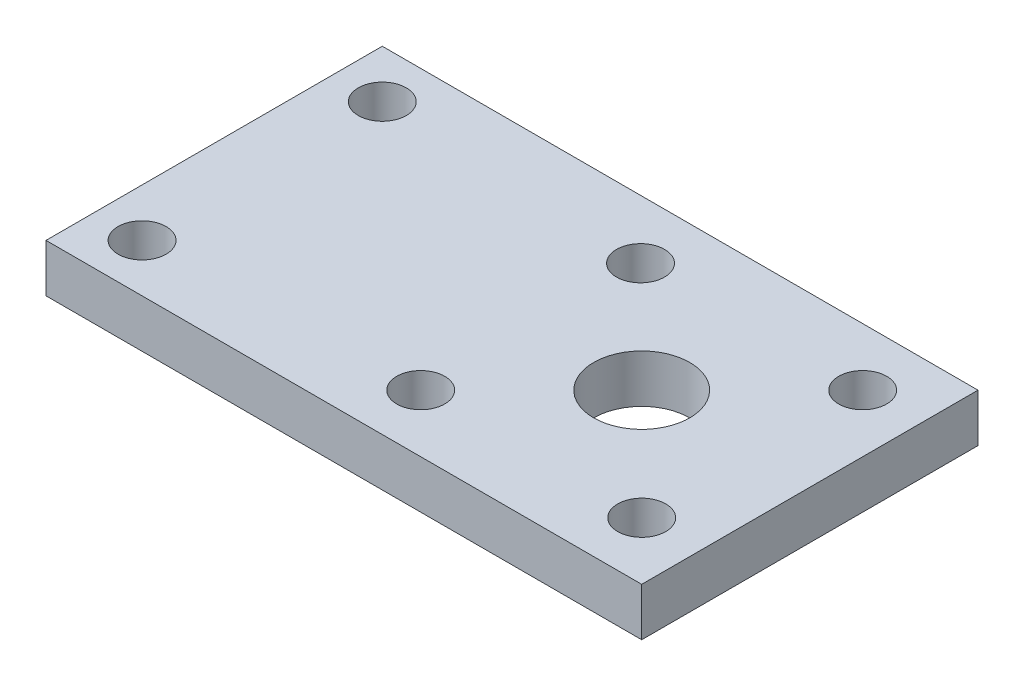
ISO-10303-21;
HEADER;
FILE_DESCRIPTION(('STEP AP214'),'2;1');
FILE_NAME('part.step','',(''),(''),'','','');
FILE_SCHEMA(('AUTOMOTIVE_DESIGN { 1 0 10303 214 1 1 1 1 }'));
ENDSEC;
DATA;
#1=APPLICATION_CONTEXT('core data for automotive mechanical design processes');
#2=APPLICATION_PROTOCOL_DEFINITION('international standard','automotive_design',2000,#1);
#3=PRODUCT_CONTEXT('',#1,'mechanical');
#4=PRODUCT('Part','Part','',(#3));
#5=PRODUCT_RELATED_PRODUCT_CATEGORY('part','',(#4));
#6=PRODUCT_DEFINITION_FORMATION('','',#4);
#7=PRODUCT_DEFINITION_CONTEXT('part definition',#1,'design');
#8=PRODUCT_DEFINITION('design','',#6,#7);
#9=PRODUCT_DEFINITION_SHAPE('','',#8);
#10=(LENGTH_UNIT() NAMED_UNIT(*) SI_UNIT(.MILLI.,.METRE.));
#11=(NAMED_UNIT(*) PLANE_ANGLE_UNIT() SI_UNIT($,.RADIAN.));
#12=(NAMED_UNIT(*) SI_UNIT($,.STERADIAN.) SOLID_ANGLE_UNIT());
#13=UNCERTAINTY_MEASURE_WITH_UNIT(LENGTH_MEASURE(1.E-05),#10,'distance_accuracy_value','');
#14=(GEOMETRIC_REPRESENTATION_CONTEXT(3) GLOBAL_UNCERTAINTY_ASSIGNED_CONTEXT((#13)) GLOBAL_UNIT_ASSIGNED_CONTEXT((#10,
#11,#12)) REPRESENTATION_CONTEXT('',''));
#15=CARTESIAN_POINT('',(0.,0.,0.));
#16=DIRECTION('',(0.,0.,1.));
#17=DIRECTION('',(1.,0.,0.));
#18=AXIS2_PLACEMENT_3D('',#15,#16,#17);
#19=CARTESIAN_POINT('',(0.,5.,0.));
#20=DIRECTION('',(1.,0.,0.));
#21=DIRECTION('',(0.,0.,-1.));
#22=AXIS2_PLACEMENT_3D('',#19,#20,#21);
#23=PLANE('',#22);
#24=DIRECTION('',(0.,0.,1.));
#25=VECTOR('',#24,1.);
#26=CARTESIAN_POINT('',(0.,0.,0.));
#27=LINE('',#26,#25);
#28=CARTESIAN_POINT('',(0.,0.,-35.));
#29=VERTEX_POINT('',#28);
#30=CARTESIAN_POINT('',(0.,0.,0.));
#31=VERTEX_POINT('',#30);
#32=EDGE_CURVE('E100',#29,#31,#27,.T.);
#33=ORIENTED_EDGE('',*,*,#32,.T.);
#34=DIRECTION('',(0.,-1.,0.));
#35=VECTOR('',#34,1.);
#36=CARTESIAN_POINT('',(0.,5.,0.));
#37=LINE('',#36,#35);
#38=CARTESIAN_POINT('',(0.,5.,0.));
#39=VERTEX_POINT('',#38);
#40=EDGE_CURVE('E11',#39,#31,#37,.T.);
#41=ORIENTED_EDGE('',*,*,#40,.F.);
#42=DIRECTION('',(0.,0.,1.));
#43=VECTOR('',#42,1.);
#44=CARTESIAN_POINT('',(0.,5.,0.));
#45=LINE('',#44,#43);
#46=CARTESIAN_POINT('',(0.,5.,-35.));
#47=VERTEX_POINT('',#46);
#48=EDGE_CURVE('E88',#47,#39,#45,.T.);
#49=ORIENTED_EDGE('',*,*,#48,.F.);
#50=DIRECTION('',(0.,-1.,0.));
#51=VECTOR('',#50,1.);
#52=CARTESIAN_POINT('',(0.,5.,-35.));
#53=LINE('',#52,#51);
#54=EDGE_CURVE('E96',#47,#29,#53,.T.);
#55=ORIENTED_EDGE('',*,*,#54,.T.);
#56=EDGE_LOOP('',(#33,#41,#49,#55));
#57=FACE_BOUND('',#56,.T.);
#58=ADVANCED_FACE('F37',(#57),#23,.F.);
#59=CARTESIAN_POINT('',(0.,5.,0.));
#60=DIRECTION('',(0.,0.,-1.));
#61=DIRECTION('',(-1.,0.,0.));
#62=AXIS2_PLACEMENT_3D('',#59,#60,#61);
#63=PLANE('',#62);
#64=DIRECTION('',(1.,0.,0.));
#65=VECTOR('',#64,1.);
#66=CARTESIAN_POINT('',(0.,0.,0.));
#67=LINE('',#66,#65);
#68=CARTESIAN_POINT('',(62.,0.,0.));
#69=VERTEX_POINT('',#68);
#70=EDGE_CURVE('E92',#31,#69,#67,.T.);
#71=ORIENTED_EDGE('',*,*,#70,.T.);
#72=DIRECTION('',(0.,-1.,0.));
#73=VECTOR('',#72,1.);
#74=CARTESIAN_POINT('',(62.,5.,0.));
#75=LINE('',#74,#73);
#76=CARTESIAN_POINT('',(62.,5.,0.));
#77=VERTEX_POINT('',#76);
#78=EDGE_CURVE('E45',#77,#69,#75,.T.);
#79=ORIENTED_EDGE('',*,*,#78,.F.);
#80=DIRECTION('',(1.,0.,0.));
#81=VECTOR('',#80,1.);
#82=CARTESIAN_POINT('',(0.,5.,0.));
#83=LINE('',#82,#81);
#84=EDGE_CURVE('E83',#39,#77,#83,.T.);
#85=ORIENTED_EDGE('',*,*,#84,.F.);
#86=ORIENTED_EDGE('',*,*,#40,.T.);
#87=EDGE_LOOP('',(#71,#79,#85,#86));
#88=FACE_BOUND('',#87,.T.);
#89=ADVANCED_FACE('F91',(#88),#63,.F.);
#90=CARTESIAN_POINT('',(62.,5.,0.));
#91=DIRECTION('',(-1.,0.,0.));
#92=DIRECTION('',(0.,0.,1.));
#93=AXIS2_PLACEMENT_3D('',#90,#91,#92);
#94=PLANE('',#93);
#95=DIRECTION('',(0.,0.,-1.));
#96=VECTOR('',#95,1.);
#97=CARTESIAN_POINT('',(62.,0.,0.));
#98=LINE('',#97,#96);
#99=CARTESIAN_POINT('',(62.,0.,-35.));
#100=VERTEX_POINT('',#99);
#101=EDGE_CURVE('E70',#69,#100,#98,.T.);
#102=ORIENTED_EDGE('',*,*,#101,.T.);
#103=DIRECTION('',(0.,-1.,0.));
#104=VECTOR('',#103,1.);
#105=CARTESIAN_POINT('',(62.,5.,-35.));
#106=LINE('',#105,#104);
#107=CARTESIAN_POINT('',(62.,5.,-35.));
#108=VERTEX_POINT('',#107);
#109=EDGE_CURVE('E93',#108,#100,#106,.T.);
#110=ORIENTED_EDGE('',*,*,#109,.F.);
#111=DIRECTION('',(0.,0.,-1.));
#112=VECTOR('',#111,1.);
#113=CARTESIAN_POINT('',(62.,5.,0.));
#114=LINE('',#113,#112);
#115=EDGE_CURVE('E86',#77,#108,#114,.T.);
#116=ORIENTED_EDGE('',*,*,#115,.F.);
#117=ORIENTED_EDGE('',*,*,#78,.T.);
#118=EDGE_LOOP('',(#102,#110,#116,#117));
#119=FACE_BOUND('',#118,.T.);
#120=ADVANCED_FACE('F94',(#119),#94,.F.);
#121=CARTESIAN_POINT('',(0.,5.,-35.));
#122=DIRECTION('',(0.,0.,1.));
#123=DIRECTION('',(1.,0.,0.));
#124=AXIS2_PLACEMENT_3D('',#121,#122,#123);
#125=PLANE('',#124);
#126=DIRECTION('',(-1.,0.,0.));
#127=VECTOR('',#126,1.);
#128=CARTESIAN_POINT('',(0.,0.,-35.));
#129=LINE('',#128,#127);
#130=EDGE_CURVE('E76',#100,#29,#129,.T.);
#131=ORIENTED_EDGE('',*,*,#130,.T.);
#132=ORIENTED_EDGE('',*,*,#54,.F.);
#133=DIRECTION('',(-1.,0.,0.));
#134=VECTOR('',#133,1.);
#135=CARTESIAN_POINT('',(0.,5.,-35.));
#136=LINE('',#135,#134);
#137=EDGE_CURVE('E53',#108,#47,#136,.T.);
#138=ORIENTED_EDGE('',*,*,#137,.F.);
#139=ORIENTED_EDGE('',*,*,#109,.T.);
#140=EDGE_LOOP('',(#131,#132,#138,#139));
#141=FACE_BOUND('',#140,.T.);
#142=ADVANCED_FACE('F108',(#141),#125,.F.);
#143=CARTESIAN_POINT('',(0.,5.,0.));
#144=DIRECTION('',(0.,-1.,0.));
#145=DIRECTION('',(0.,0.,-1.));
#146=AXIS2_PLACEMENT_3D('',#143,#144,#145);
#147=PLANE('',#146);
#148=CARTESIAN_POINT('',(56.,5.,-6.));
#149=DIRECTION('',(0.,1.,0.));
#150=DIRECTION('',(0.,0.,1.));
#151=AXIS2_PLACEMENT_3D('',#148,#149,#150);
#152=CIRCLE('',#151,2.49999999999999);
#153=CARTESIAN_POINT('',(56.,5.,-3.50000000000001));
#154=VERTEX_POINT('',#153);
#155=EDGE_CURVE('E129',#154,#154,#152,.T.);
#156=ORIENTED_EDGE('',*,*,#155,.F.);
#157=EDGE_LOOP('',(#156));
#158=FACE_BOUND('',#157,.T.);
#159=CARTESIAN_POINT('',(33.,5.,-28.8775977211584));
#160=DIRECTION('',(0.,1.,0.));
#161=DIRECTION('',(0.,0.,1.));
#162=AXIS2_PLACEMENT_3D('',#159,#160,#161);
#163=CIRCLE('',#162,2.5);
#164=CARTESIAN_POINT('',(33.,5.,-26.3775977211584));
#165=VERTEX_POINT('',#164);
#166=EDGE_CURVE('E135',#165,#165,#163,.T.);
#167=ORIENTED_EDGE('',*,*,#166,.F.);
#168=EDGE_LOOP('',(#167));
#169=FACE_BOUND('',#168,.T.);
#170=CARTESIAN_POINT('',(33.,5.,-6.));
#171=DIRECTION('',(0.,1.,0.));
#172=DIRECTION('',(0.,0.,1.));
#173=AXIS2_PLACEMENT_3D('',#170,#171,#172);
#174=CIRCLE('',#173,2.5);
#175=CARTESIAN_POINT('',(33.,5.,-3.5));
#176=VERTEX_POINT('',#175);
#177=EDGE_CURVE('E136',#176,#176,#174,.T.);
#178=ORIENTED_EDGE('',*,*,#177,.F.);
#179=EDGE_LOOP('',(#178));
#180=FACE_BOUND('',#179,.T.);
#181=CARTESIAN_POINT('',(44.5,5.,-17.5));
#182=DIRECTION('',(0.,1.,0.));
#183=DIRECTION('',(0.,0.,1.));
#184=AXIS2_PLACEMENT_3D('',#181,#182,#183);
#185=CIRCLE('',#184,5.);
#186=CARTESIAN_POINT('',(44.5,5.,-12.5));
#187=VERTEX_POINT('',#186);
#188=EDGE_CURVE('E147',#187,#187,#185,.T.);
#189=ORIENTED_EDGE('',*,*,#188,.F.);
#190=EDGE_LOOP('',(#189));
#191=FACE_BOUND('',#190,.T.);
#192=CARTESIAN_POINT('',(56.,5.,-29.));
#193=DIRECTION('',(0.,1.,0.));
#194=DIRECTION('',(0.,0.,1.));
#195=AXIS2_PLACEMENT_3D('',#192,#193,#194);
#196=CIRCLE('',#195,2.49999999999999);
#197=CARTESIAN_POINT('',(56.,5.,-26.5));
#198=VERTEX_POINT('',#197);
#199=EDGE_CURVE('E126',#198,#198,#196,.T.);
#200=ORIENTED_EDGE('',*,*,#199,.F.);
#201=EDGE_LOOP('',(#200));
#202=FACE_BOUND('',#201,.T.);
#203=CARTESIAN_POINT('',(5.,5.,-30.));
#204=DIRECTION('',(0.,1.,0.));
#205=DIRECTION('',(0.,0.,1.));
#206=AXIS2_PLACEMENT_3D('',#203,#204,#205);
#207=CIRCLE('',#206,2.5);
#208=CARTESIAN_POINT('',(5.,5.,-27.5));
#209=VERTEX_POINT('',#208);
#210=EDGE_CURVE('E121',#209,#209,#207,.T.);
#211=ORIENTED_EDGE('',*,*,#210,.F.);
#212=EDGE_LOOP('',(#211));
#213=FACE_BOUND('',#212,.T.);
#214=CARTESIAN_POINT('',(5.,5.,-5.));
#215=DIRECTION('',(0.,1.,0.));
#216=DIRECTION('',(0.,0.,1.));
#217=AXIS2_PLACEMENT_3D('',#214,#215,#216);
#218=CIRCLE('',#217,2.5);
#219=CARTESIAN_POINT('',(5.,5.,-2.5));
#220=VERTEX_POINT('',#219);
#221=EDGE_CURVE('E117',#220,#220,#218,.T.);
#222=ORIENTED_EDGE('',*,*,#221,.F.);
#223=EDGE_LOOP('',(#222));
#224=FACE_BOUND('',#223,.T.);
#225=ORIENTED_EDGE('',*,*,#48,.T.);
#226=ORIENTED_EDGE('',*,*,#84,.T.);
#227=ORIENTED_EDGE('',*,*,#115,.T.);
#228=ORIENTED_EDGE('',*,*,#137,.T.);
#229=EDGE_LOOP('',(#225,#226,#227,#228));
#230=FACE_BOUND('',#229,.T.);
#231=ADVANCED_FACE('F84',(#158,#169,#180,#191,#202,#213,#224,#230),#147,.F.);
#232=CARTESIAN_POINT('',(0.,0.,0.));
#233=DIRECTION('',(0.,-1.,0.));
#234=DIRECTION('',(0.,0.,-1.));
#235=AXIS2_PLACEMENT_3D('',#232,#233,#234);
#236=PLANE('',#235);
#237=CARTESIAN_POINT('',(56.,0.,-6.));
#238=DIRECTION('',(0.,1.,0.));
#239=DIRECTION('',(0.,0.,1.));
#240=AXIS2_PLACEMENT_3D('',#237,#238,#239);
#241=CIRCLE('',#240,2.49999999999999);
#242=CARTESIAN_POINT('',(56.,0.,-3.50000000000001));
#243=VERTEX_POINT('',#242);
#244=EDGE_CURVE('E139',#243,#243,#241,.T.);
#245=ORIENTED_EDGE('',*,*,#244,.T.);
#246=EDGE_LOOP('',(#245));
#247=FACE_BOUND('',#246,.T.);
#248=CARTESIAN_POINT('',(33.,0.,-28.8775977211584));
#249=DIRECTION('',(0.,1.,0.));
#250=DIRECTION('',(0.,0.,1.));
#251=AXIS2_PLACEMENT_3D('',#248,#249,#250);
#252=CIRCLE('',#251,2.5);
#253=CARTESIAN_POINT('',(33.,0.,-26.3775977211584));
#254=VERTEX_POINT('',#253);
#255=EDGE_CURVE('E132',#254,#254,#252,.T.);
#256=ORIENTED_EDGE('',*,*,#255,.T.);
#257=EDGE_LOOP('',(#256));
#258=FACE_BOUND('',#257,.T.);
#259=CARTESIAN_POINT('',(33.,0.,-6.));
#260=DIRECTION('',(0.,1.,0.));
#261=DIRECTION('',(0.,0.,1.));
#262=AXIS2_PLACEMENT_3D('',#259,#260,#261);
#263=CIRCLE('',#262,2.5);
#264=CARTESIAN_POINT('',(33.,0.,-3.5));
#265=VERTEX_POINT('',#264);
#266=EDGE_CURVE('E150',#265,#265,#263,.T.);
#267=ORIENTED_EDGE('',*,*,#266,.T.);
#268=EDGE_LOOP('',(#267));
#269=FACE_BOUND('',#268,.T.);
#270=CARTESIAN_POINT('',(44.5,0.,-17.5));
#271=DIRECTION('',(0.,1.,0.));
#272=DIRECTION('',(0.,0.,1.));
#273=AXIS2_PLACEMENT_3D('',#270,#271,#272);
#274=CIRCLE('',#273,5.);
#275=CARTESIAN_POINT('',(44.5,0.,-12.5));
#276=VERTEX_POINT('',#275);
#277=EDGE_CURVE('E144',#276,#276,#274,.T.);
#278=ORIENTED_EDGE('',*,*,#277,.T.);
#279=EDGE_LOOP('',(#278));
#280=FACE_BOUND('',#279,.T.);
#281=CARTESIAN_POINT('',(56.,0.,-29.));
#282=DIRECTION('',(0.,1.,0.));
#283=DIRECTION('',(0.,0.,1.));
#284=AXIS2_PLACEMENT_3D('',#281,#282,#283);
#285=CIRCLE('',#284,2.49999999999999);
#286=CARTESIAN_POINT('',(56.,0.,-26.5));
#287=VERTEX_POINT('',#286);
#288=EDGE_CURVE('E118',#287,#287,#285,.T.);
#289=ORIENTED_EDGE('',*,*,#288,.T.);
#290=EDGE_LOOP('',(#289));
#291=FACE_BOUND('',#290,.T.);
#292=CARTESIAN_POINT('',(5.,0.,-30.));
#293=DIRECTION('',(0.,1.,0.));
#294=DIRECTION('',(0.,0.,1.));
#295=AXIS2_PLACEMENT_3D('',#292,#293,#294);
#296=CIRCLE('',#295,2.5);
#297=CARTESIAN_POINT('',(5.,0.,-27.5));
#298=VERTEX_POINT('',#297);
#299=EDGE_CURVE('E103',#298,#298,#296,.T.);
#300=ORIENTED_EDGE('',*,*,#299,.T.);
#301=EDGE_LOOP('',(#300));
#302=FACE_BOUND('',#301,.T.);
#303=CARTESIAN_POINT('',(5.,0.,-5.));
#304=DIRECTION('',(0.,1.,0.));
#305=DIRECTION('',(0.,0.,1.));
#306=AXIS2_PLACEMENT_3D('',#303,#304,#305);
#307=CIRCLE('',#306,2.5);
#308=CARTESIAN_POINT('',(5.,0.,-2.5));
#309=VERTEX_POINT('',#308);
#310=EDGE_CURVE('E114',#309,#309,#307,.T.);
#311=ORIENTED_EDGE('',*,*,#310,.T.);
#312=EDGE_LOOP('',(#311));
#313=FACE_BOUND('',#312,.T.);
#314=ORIENTED_EDGE('',*,*,#32,.F.);
#315=ORIENTED_EDGE('',*,*,#130,.F.);
#316=ORIENTED_EDGE('',*,*,#101,.F.);
#317=ORIENTED_EDGE('',*,*,#70,.F.);
#318=EDGE_LOOP('',(#314,#315,#316,#317));
#319=FACE_BOUND('',#318,.T.);
#320=ADVANCED_FACE('F111',(#247,#258,#269,#280,#291,#302,#313,#319),#236,.T.);
#321=CARTESIAN_POINT('',(5.,0.,-5.));
#322=DIRECTION('',(0.,1.,0.));
#323=DIRECTION('',(0.,0.,1.));
#324=AXIS2_PLACEMENT_3D('',#321,#322,#323);
#325=CYLINDRICAL_SURFACE('',#324,2.5);
#326=ORIENTED_EDGE('',*,*,#310,.F.);
#327=EDGE_LOOP('',(#326));
#328=FACE_BOUND('',#327,.T.);
#329=ORIENTED_EDGE('',*,*,#221,.T.);
#330=EDGE_LOOP('',(#329));
#331=FACE_BOUND('',#330,.T.);
#332=ADVANCED_FACE('F170',(#328,#331),#325,.F.);
#333=CARTESIAN_POINT('',(5.,0.,-30.));
#334=DIRECTION('',(0.,1.,0.));
#335=DIRECTION('',(0.,0.,1.));
#336=AXIS2_PLACEMENT_3D('',#333,#334,#335);
#337=CYLINDRICAL_SURFACE('',#336,2.5);
#338=ORIENTED_EDGE('',*,*,#299,.F.);
#339=EDGE_LOOP('',(#338));
#340=FACE_BOUND('',#339,.T.);
#341=ORIENTED_EDGE('',*,*,#210,.T.);
#342=EDGE_LOOP('',(#341));
#343=FACE_BOUND('',#342,.T.);
#344=ADVANCED_FACE('F172',(#340,#343),#337,.F.);
#345=CARTESIAN_POINT('',(56.,0.,-29.));
#346=DIRECTION('',(0.,1.,0.));
#347=DIRECTION('',(0.,0.,1.));
#348=AXIS2_PLACEMENT_3D('',#345,#346,#347);
#349=CYLINDRICAL_SURFACE('',#348,2.49999999999999);
#350=ORIENTED_EDGE('',*,*,#288,.F.);
#351=EDGE_LOOP('',(#350));
#352=FACE_BOUND('',#351,.T.);
#353=ORIENTED_EDGE('',*,*,#199,.T.);
#354=EDGE_LOOP('',(#353));
#355=FACE_BOUND('',#354,.T.);
#356=ADVANCED_FACE('F179',(#352,#355),#349,.F.);
#357=CARTESIAN_POINT('',(44.5,0.,-17.5));
#358=DIRECTION('',(0.,1.,0.));
#359=DIRECTION('',(0.,0.,1.));
#360=AXIS2_PLACEMENT_3D('',#357,#358,#359);
#361=CYLINDRICAL_SURFACE('',#360,5.);
#362=ORIENTED_EDGE('',*,*,#277,.F.);
#363=EDGE_LOOP('',(#362));
#364=FACE_BOUND('',#363,.T.);
#365=ORIENTED_EDGE('',*,*,#188,.T.);
#366=EDGE_LOOP('',(#365));
#367=FACE_BOUND('',#366,.T.);
#368=ADVANCED_FACE('F219',(#364,#367),#361,.F.);
#369=CARTESIAN_POINT('',(33.,0.,-6.));
#370=DIRECTION('',(0.,1.,0.));
#371=DIRECTION('',(0.,0.,1.));
#372=AXIS2_PLACEMENT_3D('',#369,#370,#371);
#373=CYLINDRICAL_SURFACE('',#372,2.5);
#374=ORIENTED_EDGE('',*,*,#266,.F.);
#375=EDGE_LOOP('',(#374));
#376=FACE_BOUND('',#375,.T.);
#377=ORIENTED_EDGE('',*,*,#177,.T.);
#378=EDGE_LOOP('',(#377));
#379=FACE_BOUND('',#378,.T.);
#380=ADVANCED_FACE('F156',(#376,#379),#373,.F.);
#381=CARTESIAN_POINT('',(33.,0.,-28.8775977211584));
#382=DIRECTION('',(0.,1.,0.));
#383=DIRECTION('',(0.,0.,1.));
#384=AXIS2_PLACEMENT_3D('',#381,#382,#383);
#385=CYLINDRICAL_SURFACE('',#384,2.5);
#386=ORIENTED_EDGE('',*,*,#255,.F.);
#387=EDGE_LOOP('',(#386));
#388=FACE_BOUND('',#387,.T.);
#389=ORIENTED_EDGE('',*,*,#166,.T.);
#390=EDGE_LOOP('',(#389));
#391=FACE_BOUND('',#390,.T.);
#392=ADVANCED_FACE('F241',(#388,#391),#385,.F.);
#393=CARTESIAN_POINT('',(56.,0.,-6.));
#394=DIRECTION('',(0.,1.,0.));
#395=DIRECTION('',(0.,0.,1.));
#396=AXIS2_PLACEMENT_3D('',#393,#394,#395);
#397=CYLINDRICAL_SURFACE('',#396,2.49999999999999);
#398=ORIENTED_EDGE('',*,*,#244,.F.);
#399=EDGE_LOOP('',(#398));
#400=FACE_BOUND('',#399,.T.);
#401=ORIENTED_EDGE('',*,*,#155,.T.);
#402=EDGE_LOOP('',(#401));
#403=FACE_BOUND('',#402,.T.);
#404=ADVANCED_FACE('F252',(#400,#403),#397,.F.);
#405=CLOSED_SHELL('',(#58,#89,#120,#142,#231,#320,#332,#344,#356,#368,#380,#392,#404));
#406=MANIFOLD_SOLID_BREP('B2',#405);
#407=ADVANCED_BREP_SHAPE_REPRESENTATION('',(#18,#406),#14);
#408=SHAPE_DEFINITION_REPRESENTATION(#9,#407);
ENDSEC;
END-ISO-10303-21;
